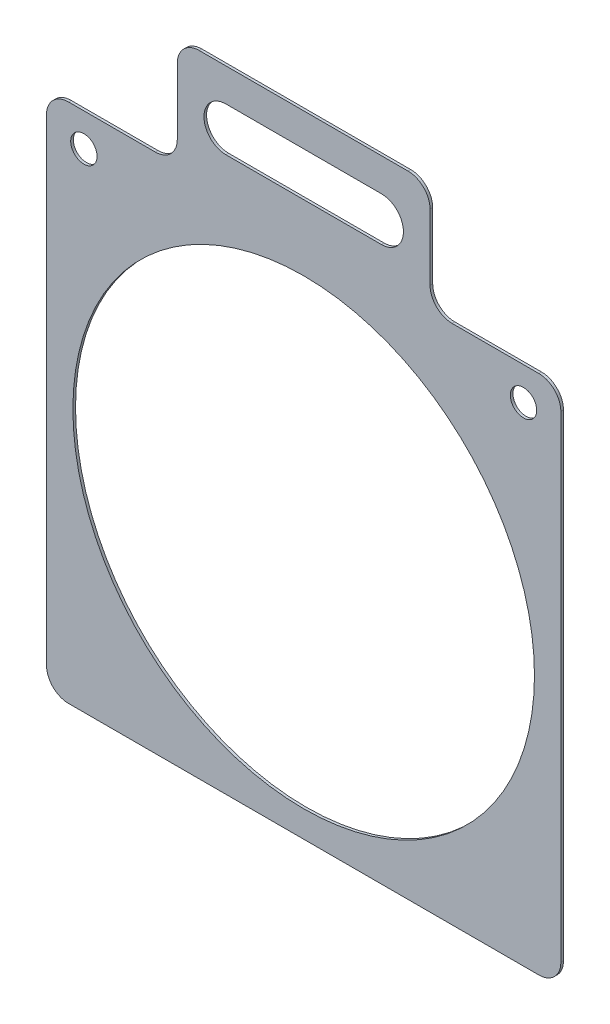
ISO-10303-21;
HEADER;
FILE_DESCRIPTION(('STEP AP214'),'2;1');
FILE_NAME('part.step','',(''),(''),'','','');
FILE_SCHEMA(('AUTOMOTIVE_DESIGN { 1 0 10303 214 1 1 1 1 }'));
ENDSEC;
DATA;
#1=APPLICATION_CONTEXT('core data for automotive mechanical design processes');
#2=APPLICATION_PROTOCOL_DEFINITION('international standard','automotive_design',2000,#1);
#3=PRODUCT_CONTEXT('',#1,'mechanical');
#4=PRODUCT('Part','Part','',(#3));
#5=PRODUCT_RELATED_PRODUCT_CATEGORY('part','',(#4));
#6=PRODUCT_DEFINITION_FORMATION('','',#4);
#7=PRODUCT_DEFINITION_CONTEXT('part definition',#1,'design');
#8=PRODUCT_DEFINITION('design','',#6,#7);
#9=PRODUCT_DEFINITION_SHAPE('','',#8);
#10=(LENGTH_UNIT() NAMED_UNIT(*) SI_UNIT(.MILLI.,.METRE.));
#11=(NAMED_UNIT(*) PLANE_ANGLE_UNIT() SI_UNIT($,.RADIAN.));
#12=(NAMED_UNIT(*) SI_UNIT($,.STERADIAN.) SOLID_ANGLE_UNIT());
#13=UNCERTAINTY_MEASURE_WITH_UNIT(LENGTH_MEASURE(1.E-05),#10,'distance_accuracy_value','');
#14=(GEOMETRIC_REPRESENTATION_CONTEXT(3) GLOBAL_UNCERTAINTY_ASSIGNED_CONTEXT((#13)) GLOBAL_UNIT_ASSIGNED_CONTEXT((#10,
#11,#12)) REPRESENTATION_CONTEXT('',''));
#15=CARTESIAN_POINT('',(0.,0.,0.));
#16=DIRECTION('',(0.,0.,1.));
#17=DIRECTION('',(1.,0.,0.));
#18=AXIS2_PLACEMENT_3D('',#15,#16,#17);
#19=CARTESIAN_POINT('',(-117.,120.,1.19999999999999));
#20=DIRECTION('',(0.,-1.,0.));
#21=DIRECTION('',(1.,0.,0.));
#22=AXIS2_PLACEMENT_3D('',#19,#20,#21);
#23=PLANE('',#22);
#24=DIRECTION('',(-1.,0.,0.));
#25=VECTOR('',#24,1.);
#26=CARTESIAN_POINT('',(-117.,120.,1.19999999999999));
#27=LINE('',#26,#25);
#28=CARTESIAN_POINT('',(-67.5000000000002,120.000000000001,1.19999999999999));
#29=VERTEX_POINT('',#28);
#30=CARTESIAN_POINT('',(-107.,120.,1.19999999999999));
#31=VERTEX_POINT('',#30);
#32=EDGE_CURVE('E276',#29,#31,#27,.T.);
#33=ORIENTED_EDGE('',*,*,#32,.F.);
#34=DIRECTION('',(0.,0.,1.));
#35=VECTOR('',#34,1.);
#36=CARTESIAN_POINT('',(-67.5000000000002,120.000000000001,1.19999999999999));
#37=LINE('',#36,#35);
#38=CARTESIAN_POINT('',(-67.5000000000002,120.000000000001,0.));
#39=VERTEX_POINT('',#38);
#40=EDGE_CURVE('E361',#29,#39,#37,.F.);
#41=ORIENTED_EDGE('',*,*,#40,.T.);
#42=DIRECTION('',(-1.,0.,0.));
#43=VECTOR('',#42,1.);
#44=CARTESIAN_POINT('',(-117.,120.,0.));
#45=LINE('',#44,#43);
#46=CARTESIAN_POINT('',(-107.,120.,0.));
#47=VERTEX_POINT('',#46);
#48=EDGE_CURVE('E291',#39,#47,#45,.T.);
#49=ORIENTED_EDGE('',*,*,#48,.T.);
#50=DIRECTION('',(0.,0.,-1.));
#51=VECTOR('',#50,1.);
#52=CARTESIAN_POINT('',(-107.,120.,1.19999999999999));
#53=LINE('',#52,#51);
#54=EDGE_CURVE('E358',#47,#31,#53,.F.);
#55=ORIENTED_EDGE('',*,*,#54,.T.);
#56=EDGE_LOOP('',(#33,#41,#49,#55));
#57=FACE_BOUND('',#56,.T.);
#58=ADVANCED_FACE('F40',(#57),#23,.F.);
#59=CARTESIAN_POINT('',(0.,0.,1.19999999999998));
#60=DIRECTION('',(0.,0.,1.));
#61=DIRECTION('',(1.,0.,0.));
#62=AXIS2_PLACEMENT_3D('',#59,#60,#61);
#63=PLANE('',#62);
#64=CARTESIAN_POINT('',(-100.,105.,1.19999999999999));
#65=DIRECTION('',(0.,0.,1.));
#66=DIRECTION('',(1.,0.,0.));
#67=AXIS2_PLACEMENT_3D('',#64,#65,#66);
#68=CIRCLE('',#67,6.);
#69=CARTESIAN_POINT('',(-94.0000000000001,105.,1.19999999999999));
#70=VERTEX_POINT('',#69);
#71=EDGE_CURVE('E247',#70,#70,#68,.T.);
#72=ORIENTED_EDGE('',*,*,#71,.F.);
#73=EDGE_LOOP('',(#72));
#74=FACE_BOUND('',#73,.T.);
#75=DIRECTION('',(0.,1.,0.));
#76=VECTOR('',#75,1.);
#77=CARTESIAN_POINT('',(57.5000000000001,170.000000000002,1.19999999999999));
#78=LINE('',#77,#76);
#79=CARTESIAN_POINT('',(57.5000000000003,130.000000000001,1.19999999999999));
#80=VERTEX_POINT('',#79);
#81=CARTESIAN_POINT('',(57.5000000000001,160.000000000002,1.19999999999999));
#82=VERTEX_POINT('',#81);
#83=EDGE_CURVE('E217',#80,#82,#78,.T.);
#84=ORIENTED_EDGE('',*,*,#83,.T.);
#85=CARTESIAN_POINT('',(47.5,160.000000000002,1.19999999999999));
#86=DIRECTION('',(0.,0.,1.));
#87=DIRECTION('',(1.,0.,0.));
#88=AXIS2_PLACEMENT_3D('',#85,#86,#87);
#89=CIRCLE('',#88,10.);
#90=CARTESIAN_POINT('',(47.5000000000002,170.000000000002,1.19999999999999));
#91=VERTEX_POINT('',#90);
#92=EDGE_CURVE('E325',#82,#91,#89,.T.);
#93=ORIENTED_EDGE('',*,*,#92,.T.);
#94=DIRECTION('',(-1.,0.,0.));
#95=VECTOR('',#94,1.);
#96=CARTESIAN_POINT('',(-57.5000000000002,170.000000000002,1.19999999999999));
#97=LINE('',#96,#95);
#98=CARTESIAN_POINT('',(-47.5000000000001,170.000000000002,1.19999999999999));
#99=VERTEX_POINT('',#98);
#100=EDGE_CURVE('E225',#91,#99,#97,.T.);
#101=ORIENTED_EDGE('',*,*,#100,.T.);
#102=CARTESIAN_POINT('',(-47.5,160.000000000002,1.19999999999999));
#103=DIRECTION('',(0.,0.,1.));
#104=DIRECTION('',(1.,0.,0.));
#105=AXIS2_PLACEMENT_3D('',#102,#103,#104);
#106=CIRCLE('',#105,10.);
#107=CARTESIAN_POINT('',(-57.5000000000002,160.000000000002,1.19999999999999));
#108=VERTEX_POINT('',#107);
#109=EDGE_CURVE('E322',#99,#108,#106,.T.);
#110=ORIENTED_EDGE('',*,*,#109,.T.);
#111=DIRECTION('',(0.,-1.,0.));
#112=VECTOR('',#111,1.);
#113=CARTESIAN_POINT('',(-57.4999999999999,120.000000000002,1.19999999999999));
#114=LINE('',#113,#112);
#115=CARTESIAN_POINT('',(-57.5000000000002,130.000000000001,1.19999999999998));
#116=VERTEX_POINT('',#115);
#117=EDGE_CURVE('E229',#108,#116,#114,.T.);
#118=ORIENTED_EDGE('',*,*,#117,.T.);
#119=CARTESIAN_POINT('',(-67.5,130.000000000001,1.19999999999999));
#120=DIRECTION('',(0.,0.,1.));
#121=DIRECTION('',(1.,0.,0.));
#122=AXIS2_PLACEMENT_3D('',#119,#120,#121);
#123=CIRCLE('',#122,10.);
#124=EDGE_CURVE('E49',#116,#29,#123,.F.);
#125=ORIENTED_EDGE('',*,*,#124,.T.);
#126=ORIENTED_EDGE('',*,*,#32,.T.);
#127=CARTESIAN_POINT('',(-107.,110.,1.19999999999999));
#128=DIRECTION('',(0.,0.,1.));
#129=DIRECTION('',(1.,0.,0.));
#130=AXIS2_PLACEMENT_3D('',#127,#128,#129);
#131=CIRCLE('',#130,10.);
#132=CARTESIAN_POINT('',(-117.,110.,1.19999999999999));
#133=VERTEX_POINT('',#132);
#134=EDGE_CURVE('E319',#31,#133,#131,.T.);
#135=ORIENTED_EDGE('',*,*,#134,.T.);
#136=DIRECTION('',(0.,-1.,0.));
#137=VECTOR('',#136,1.);
#138=CARTESIAN_POINT('',(-117.,120.,1.19999999999999));
#139=LINE('',#138,#137);
#140=CARTESIAN_POINT('',(-117.,-107.,1.19999999999998));
#141=VERTEX_POINT('',#140);
#142=EDGE_CURVE('E263',#133,#141,#139,.T.);
#143=ORIENTED_EDGE('',*,*,#142,.T.);
#144=CARTESIAN_POINT('',(-107.,-107.,1.19999999999998));
#145=DIRECTION('',(0.,0.,1.));
#146=DIRECTION('',(1.,0.,0.));
#147=AXIS2_PLACEMENT_3D('',#144,#145,#146);
#148=CIRCLE('',#147,10.);
#149=CARTESIAN_POINT('',(-107.,-117.,1.19999999999998));
#150=VERTEX_POINT('',#149);
#151=EDGE_CURVE('E313',#141,#150,#148,.T.);
#152=ORIENTED_EDGE('',*,*,#151,.T.);
#153=DIRECTION('',(1.,0.,0.));
#154=VECTOR('',#153,1.);
#155=CARTESIAN_POINT('',(-117.,-117.,1.19999999999998));
#156=LINE('',#155,#154);
#157=CARTESIAN_POINT('',(107.,-117.,1.19999999999998));
#158=VERTEX_POINT('',#157);
#159=EDGE_CURVE('E267',#150,#158,#156,.T.);
#160=ORIENTED_EDGE('',*,*,#159,.T.);
#161=CARTESIAN_POINT('',(107.,-107.,1.19999999999998));
#162=DIRECTION('',(0.,0.,1.));
#163=DIRECTION('',(1.,0.,0.));
#164=AXIS2_PLACEMENT_3D('',#161,#162,#163);
#165=CIRCLE('',#164,10.);
#166=CARTESIAN_POINT('',(117.,-107.,1.19999999999998));
#167=VERTEX_POINT('',#166);
#168=EDGE_CURVE('E316',#158,#167,#165,.T.);
#169=ORIENTED_EDGE('',*,*,#168,.T.);
#170=DIRECTION('',(0.,1.,0.));
#171=VECTOR('',#170,1.);
#172=CARTESIAN_POINT('',(117.,120.000000000001,1.19999999999998));
#173=LINE('',#172,#171);
#174=CARTESIAN_POINT('',(117.,110.,1.19999999999998));
#175=VERTEX_POINT('',#174);
#176=EDGE_CURVE('E272',#167,#175,#173,.T.);
#177=ORIENTED_EDGE('',*,*,#176,.T.);
#178=CARTESIAN_POINT('',(107.,110.000000000001,1.19999999999998));
#179=DIRECTION('',(0.,0.,1.));
#180=DIRECTION('',(1.,0.,0.));
#181=AXIS2_PLACEMENT_3D('',#178,#179,#180);
#182=CIRCLE('',#181,10.);
#183=CARTESIAN_POINT('',(107.,120.000000000001,1.19999999999998));
#184=VERTEX_POINT('',#183);
#185=EDGE_CURVE('E310',#175,#184,#182,.T.);
#186=ORIENTED_EDGE('',*,*,#185,.T.);
#187=CARTESIAN_POINT('',(67.5000000000001,120.000000000001,1.19999999999998));
#188=VERTEX_POINT('',#187);
#189=EDGE_CURVE('E280',#184,#188,#27,.T.);
#190=ORIENTED_EDGE('',*,*,#189,.T.);
#191=CARTESIAN_POINT('',(67.5000000000003,130.000000000001,1.19999999999998));
#192=DIRECTION('',(0.,0.,1.));
#193=DIRECTION('',(1.,0.,0.));
#194=AXIS2_PLACEMENT_3D('',#191,#192,#193);
#195=CIRCLE('',#194,10.);
#196=EDGE_CURVE('E384',#188,#80,#195,.F.);
#197=ORIENTED_EDGE('',*,*,#196,.T.);
#198=EDGE_LOOP('',(#84,#93,#101,#110,#118,#125,#126,#135,#143,#152,#160,#169,#177,#186,#190,#197));
#199=FACE_BOUND('',#198,.T.);
#200=CARTESIAN_POINT('',(0.,0.,1.19999999999998));
#201=DIRECTION('',(0.,0.,1.));
#202=DIRECTION('',(1.,0.,0.));
#203=AXIS2_PLACEMENT_3D('',#200,#201,#202);
#204=CIRCLE('',#203,105.);
#205=CARTESIAN_POINT('',(105.,0.,1.19999999999998));
#206=VERTEX_POINT('',#205);
#207=EDGE_CURVE('E255',#206,#206,#204,.T.);
#208=ORIENTED_EDGE('',*,*,#207,.F.);
#209=EDGE_LOOP('',(#208));
#210=FACE_BOUND('',#209,.T.);
#211=CARTESIAN_POINT('',(100.,105.000000000001,1.19999999999998));
#212=DIRECTION('',(0.,0.,1.));
#213=DIRECTION('',(-1.,0.,0.));
#214=AXIS2_PLACEMENT_3D('',#211,#212,#213);
#215=CIRCLE('',#214,6.);
#216=CARTESIAN_POINT('',(94.0000000000002,105.000000000001,1.19999999999998));
#217=VERTEX_POINT('',#216);
#218=EDGE_CURVE('E237',#217,#217,#215,.T.);
#219=ORIENTED_EDGE('',*,*,#218,.F.);
#220=EDGE_LOOP('',(#219));
#221=FACE_BOUND('',#220,.T.);
#222=DIRECTION('',(1.,0.,0.));
#223=VECTOR('',#222,1.);
#224=CARTESIAN_POINT('',(-35.3706002300001,134.999999999999,1.19999999999999));
#225=LINE('',#224,#223);
#226=CARTESIAN_POINT('',(-35.3706002300001,134.999999999999,1.19999999999999));
#227=VERTEX_POINT('',#226);
#228=CARTESIAN_POINT('',(35.3706002300002,135.,1.19999999999999));
#229=VERTEX_POINT('',#228);
#230=EDGE_CURVE('E195',#227,#229,#225,.T.);
#231=ORIENTED_EDGE('',*,*,#230,.F.);
#232=CARTESIAN_POINT('',(-35.3706002300002,145.000000000002,1.19999999999999));
#233=DIRECTION('',(0.,0.,1.));
#234=DIRECTION('',(1.,0.,0.));
#235=AXIS2_PLACEMENT_3D('',#232,#233,#234);
#236=CIRCLE('',#235,10.0000000000015);
#237=CARTESIAN_POINT('',(-35.3706002300001,155.000000000002,1.19999999999999));
#238=VERTEX_POINT('',#237);
#239=EDGE_CURVE('E202',#238,#227,#236,.T.);
#240=ORIENTED_EDGE('',*,*,#239,.F.);
#241=DIRECTION('',(-1.,0.,0.));
#242=VECTOR('',#241,1.);
#243=CARTESIAN_POINT('',(-35.3706002300001,155.000000000002,1.19999999999999));
#244=LINE('',#243,#242);
#245=CARTESIAN_POINT('',(35.37060023,155.000000000002,1.19999999999999));
#246=VERTEX_POINT('',#245);
#247=EDGE_CURVE('E206',#246,#238,#244,.T.);
#248=ORIENTED_EDGE('',*,*,#247,.F.);
#249=CARTESIAN_POINT('',(35.3706002300001,145.000000000002,1.19999999999999));
#250=DIRECTION('',(0.,0.,1.));
#251=DIRECTION('',(1.,0.,0.));
#252=AXIS2_PLACEMENT_3D('',#249,#250,#251);
#253=CIRCLE('',#252,10.0000000000015);
#254=EDGE_CURVE('E185',#229,#246,#253,.T.);
#255=ORIENTED_EDGE('',*,*,#254,.F.);
#256=EDGE_LOOP('',(#231,#240,#248,#255));
#257=FACE_BOUND('',#256,.T.);
#258=ADVANCED_FACE('F204',(#74,#199,#210,#221,#257),#63,.T.);
#259=CARTESIAN_POINT('',(0.,0.,0.));
#260=DIRECTION('',(0.,0.,1.));
#261=DIRECTION('',(1.,0.,0.));
#262=AXIS2_PLACEMENT_3D('',#259,#260,#261);
#263=PLANE('',#262);
#264=DIRECTION('',(1.,0.,0.));
#265=VECTOR('',#264,1.);
#266=CARTESIAN_POINT('',(-57.5000000000002,170.000000000002,0.));
#267=LINE('',#266,#265);
#268=CARTESIAN_POINT('',(-47.5000000000001,170.000000000002,0.));
#269=VERTEX_POINT('',#268);
#270=CARTESIAN_POINT('',(47.5000000000002,170.000000000002,0.));
#271=VERTEX_POINT('',#270);
#272=EDGE_CURVE('E236',#269,#271,#267,.T.);
#273=ORIENTED_EDGE('',*,*,#272,.T.);
#274=CARTESIAN_POINT('',(47.5,160.000000000002,0.));
#275=DIRECTION('',(0.,0.,1.));
#276=DIRECTION('',(1.,0.,0.));
#277=AXIS2_PLACEMENT_3D('',#274,#275,#276);
#278=CIRCLE('',#277,10.);
#279=CARTESIAN_POINT('',(57.5000000000001,160.000000000002,0.));
#280=VERTEX_POINT('',#279);
#281=EDGE_CURVE('E348',#271,#280,#278,.F.);
#282=ORIENTED_EDGE('',*,*,#281,.T.);
#283=DIRECTION('',(0.,-1.,0.));
#284=VECTOR('',#283,1.);
#285=CARTESIAN_POINT('',(57.5000000000001,170.000000000002,0.));
#286=LINE('',#285,#284);
#287=CARTESIAN_POINT('',(57.5000000000003,130.000000000001,0.));
#288=VERTEX_POINT('',#287);
#289=EDGE_CURVE('E246',#280,#288,#286,.T.);
#290=ORIENTED_EDGE('',*,*,#289,.T.);
#291=CARTESIAN_POINT('',(67.5000000000003,130.000000000001,0.));
#292=DIRECTION('',(0.,0.,1.));
#293=DIRECTION('',(1.,0.,0.));
#294=AXIS2_PLACEMENT_3D('',#291,#292,#293);
#295=CIRCLE('',#294,10.);
#296=CARTESIAN_POINT('',(67.5000000000001,120.000000000001,0.));
#297=VERTEX_POINT('',#296);
#298=EDGE_CURVE('E387',#288,#297,#295,.T.);
#299=ORIENTED_EDGE('',*,*,#298,.T.);
#300=CARTESIAN_POINT('',(107.,120.000000000001,0.));
#301=VERTEX_POINT('',#300);
#302=EDGE_CURVE('E268',#301,#297,#45,.T.);
#303=ORIENTED_EDGE('',*,*,#302,.F.);
#304=CARTESIAN_POINT('',(107.,110.000000000001,0.));
#305=DIRECTION('',(0.,0.,1.));
#306=DIRECTION('',(1.,0.,0.));
#307=AXIS2_PLACEMENT_3D('',#304,#305,#306);
#308=CIRCLE('',#307,10.);
#309=CARTESIAN_POINT('',(117.,110.,0.));
#310=VERTEX_POINT('',#309);
#311=EDGE_CURVE('E335',#301,#310,#308,.F.);
#312=ORIENTED_EDGE('',*,*,#311,.T.);
#313=DIRECTION('',(0.,1.,0.));
#314=VECTOR('',#313,1.);
#315=CARTESIAN_POINT('',(117.,120.000000000001,0.));
#316=LINE('',#315,#314);
#317=CARTESIAN_POINT('',(117.,-107.,0.));
#318=VERTEX_POINT('',#317);
#319=EDGE_CURVE('E287',#318,#310,#316,.T.);
#320=ORIENTED_EDGE('',*,*,#319,.F.);
#321=CARTESIAN_POINT('',(107.,-107.,0.));
#322=DIRECTION('',(0.,0.,1.));
#323=DIRECTION('',(1.,0.,0.));
#324=AXIS2_PLACEMENT_3D('',#321,#322,#323);
#325=CIRCLE('',#324,10.);
#326=CARTESIAN_POINT('',(107.,-117.,0.));
#327=VERTEX_POINT('',#326);
#328=EDGE_CURVE('E56',#318,#327,#325,.F.);
#329=ORIENTED_EDGE('',*,*,#328,.T.);
#330=DIRECTION('',(1.,0.,0.));
#331=VECTOR('',#330,1.);
#332=CARTESIAN_POINT('',(-117.,-117.,0.));
#333=LINE('',#332,#331);
#334=CARTESIAN_POINT('',(-107.,-117.,0.));
#335=VERTEX_POINT('',#334);
#336=EDGE_CURVE('E284',#335,#327,#333,.T.);
#337=ORIENTED_EDGE('',*,*,#336,.F.);
#338=CARTESIAN_POINT('',(-107.,-107.,0.));
#339=DIRECTION('',(0.,0.,1.));
#340=DIRECTION('',(1.,0.,0.));
#341=AXIS2_PLACEMENT_3D('',#338,#339,#340);
#342=CIRCLE('',#341,10.);
#343=CARTESIAN_POINT('',(-117.,-107.,0.));
#344=VERTEX_POINT('',#343);
#345=EDGE_CURVE('E64',#335,#344,#342,.F.);
#346=ORIENTED_EDGE('',*,*,#345,.T.);
#347=DIRECTION('',(0.,-1.,0.));
#348=VECTOR('',#347,1.);
#349=CARTESIAN_POINT('',(-117.,120.,0.));
#350=LINE('',#349,#348);
#351=CARTESIAN_POINT('',(-117.,110.,0.));
#352=VERTEX_POINT('',#351);
#353=EDGE_CURVE('E259',#352,#344,#350,.T.);
#354=ORIENTED_EDGE('',*,*,#353,.F.);
#355=CARTESIAN_POINT('',(-107.,110.,0.));
#356=DIRECTION('',(0.,0.,1.));
#357=DIRECTION('',(1.,0.,0.));
#358=AXIS2_PLACEMENT_3D('',#355,#356,#357);
#359=CIRCLE('',#358,10.);
#360=EDGE_CURVE('E342',#352,#47,#359,.F.);
#361=ORIENTED_EDGE('',*,*,#360,.T.);
#362=ORIENTED_EDGE('',*,*,#48,.F.);
#363=CARTESIAN_POINT('',(-67.5,130.000000000001,0.));
#364=DIRECTION('',(0.,0.,1.));
#365=DIRECTION('',(1.,0.,0.));
#366=AXIS2_PLACEMENT_3D('',#363,#364,#365);
#367=CIRCLE('',#366,10.);
#368=CARTESIAN_POINT('',(-57.5000000000002,130.000000000001,0.));
#369=VERTEX_POINT('',#368);
#370=EDGE_CURVE('E11',#39,#369,#367,.T.);
#371=ORIENTED_EDGE('',*,*,#370,.T.);
#372=DIRECTION('',(0.,1.,0.));
#373=VECTOR('',#372,1.);
#374=CARTESIAN_POINT('',(-57.4999999999999,120.000000000002,0.));
#375=LINE('',#374,#373);
#376=CARTESIAN_POINT('',(-57.5000000000002,160.000000000002,0.));
#377=VERTEX_POINT('',#376);
#378=EDGE_CURVE('E410',#369,#377,#375,.T.);
#379=ORIENTED_EDGE('',*,*,#378,.T.);
#380=CARTESIAN_POINT('',(-47.5,160.000000000002,0.));
#381=DIRECTION('',(0.,0.,1.));
#382=DIRECTION('',(1.,0.,0.));
#383=AXIS2_PLACEMENT_3D('',#380,#381,#382);
#384=CIRCLE('',#383,10.);
#385=EDGE_CURVE('E345',#377,#269,#384,.F.);
#386=ORIENTED_EDGE('',*,*,#385,.T.);
#387=EDGE_LOOP('',(#273,#282,#290,#299,#303,#312,#320,#329,#337,#346,#354,#361,#362,#371,#379,#386));
#388=FACE_BOUND('',#387,.T.);
#389=CARTESIAN_POINT('',(0.,0.,0.));
#390=DIRECTION('',(0.,0.,1.));
#391=DIRECTION('',(1.,0.,0.));
#392=AXIS2_PLACEMENT_3D('',#389,#390,#391);
#393=CIRCLE('',#392,105.);
#394=CARTESIAN_POINT('',(105.,0.,0.));
#395=VERTEX_POINT('',#394);
#396=EDGE_CURVE('E251',#395,#395,#393,.T.);
#397=ORIENTED_EDGE('',*,*,#396,.T.);
#398=EDGE_LOOP('',(#397));
#399=FACE_BOUND('',#398,.T.);
#400=CARTESIAN_POINT('',(-100.,105.,0.));
#401=DIRECTION('',(0.,0.,1.));
#402=DIRECTION('',(1.,0.,0.));
#403=AXIS2_PLACEMENT_3D('',#400,#401,#402);
#404=CIRCLE('',#403,6.);
#405=CARTESIAN_POINT('',(-94.0000000000001,105.,0.));
#406=VERTEX_POINT('',#405);
#407=EDGE_CURVE('E241',#406,#406,#404,.T.);
#408=ORIENTED_EDGE('',*,*,#407,.T.);
#409=EDGE_LOOP('',(#408));
#410=FACE_BOUND('',#409,.T.);
#411=CARTESIAN_POINT('',(100.,105.000000000001,0.));
#412=DIRECTION('',(0.,0.,1.));
#413=DIRECTION('',(-1.,0.,0.));
#414=AXIS2_PLACEMENT_3D('',#411,#412,#413);
#415=CIRCLE('',#414,6.);
#416=CARTESIAN_POINT('',(94.0000000000002,105.000000000001,0.));
#417=VERTEX_POINT('',#416);
#418=EDGE_CURVE('E242',#417,#417,#415,.T.);
#419=ORIENTED_EDGE('',*,*,#418,.T.);
#420=EDGE_LOOP('',(#419));
#421=FACE_BOUND('',#420,.T.);
#422=DIRECTION('',(-1.,0.,0.));
#423=VECTOR('',#422,1.);
#424=CARTESIAN_POINT('',(-35.3706002300001,134.999999999999,0.));
#425=LINE('',#424,#423);
#426=CARTESIAN_POINT('',(35.3706002300001,134.999999999999,0.));
#427=VERTEX_POINT('',#426);
#428=CARTESIAN_POINT('',(-35.3706002300001,134.999999999999,0.));
#429=VERTEX_POINT('',#428);
#430=EDGE_CURVE('E233',#427,#429,#425,.T.);
#431=ORIENTED_EDGE('',*,*,#430,.F.);
#432=CARTESIAN_POINT('',(35.3706002300001,145.000000000002,0.));
#433=DIRECTION('',(0.,0.,1.));
#434=DIRECTION('',(1.,0.,0.));
#435=AXIS2_PLACEMENT_3D('',#432,#433,#434);
#436=CIRCLE('',#435,10.0000000000015);
#437=CARTESIAN_POINT('',(35.3706002300002,155.000000000004,0.));
#438=VERTEX_POINT('',#437);
#439=EDGE_CURVE('E187',#438,#427,#436,.F.);
#440=ORIENTED_EDGE('',*,*,#439,.F.);
#441=DIRECTION('',(1.,0.,0.));
#442=VECTOR('',#441,1.);
#443=CARTESIAN_POINT('',(-35.3706002300001,155.000000000002,0.));
#444=LINE('',#443,#442);
#445=CARTESIAN_POINT('',(-35.3706002300001,155.000000000002,0.));
#446=VERTEX_POINT('',#445);
#447=EDGE_CURVE('E420',#446,#438,#444,.T.);
#448=ORIENTED_EDGE('',*,*,#447,.F.);
#449=CARTESIAN_POINT('',(-35.3706002300002,145.000000000002,0.));
#450=DIRECTION('',(0.,0.,1.));
#451=DIRECTION('',(1.,0.,0.));
#452=AXIS2_PLACEMENT_3D('',#449,#450,#451);
#453=CIRCLE('',#452,10.0000000000015);
#454=EDGE_CURVE('E415',#429,#446,#453,.F.);
#455=ORIENTED_EDGE('',*,*,#454,.F.);
#456=EDGE_LOOP('',(#431,#440,#448,#455));
#457=FACE_BOUND('',#456,.T.);
#458=ADVANCED_FACE('F408',(#388,#399,#410,#421,#457),#263,.F.);
#459=CARTESIAN_POINT('',(-117.,120.,1.19999999999999));
#460=DIRECTION('',(1.,0.,0.));
#461=DIRECTION('',(0.,1.,0.));
#462=AXIS2_PLACEMENT_3D('',#459,#460,#461);
#463=PLANE('',#462);
#464=ORIENTED_EDGE('',*,*,#142,.F.);
#465=DIRECTION('',(0.,0.,-1.));
#466=VECTOR('',#465,1.);
#467=CARTESIAN_POINT('',(-117.,110.,1.19999999999999));
#468=LINE('',#467,#466);
#469=EDGE_CURVE('E367',#133,#352,#468,.T.);
#470=ORIENTED_EDGE('',*,*,#469,.T.);
#471=ORIENTED_EDGE('',*,*,#353,.T.);
#472=DIRECTION('',(0.,0.,-1.));
#473=VECTOR('',#472,1.);
#474=CARTESIAN_POINT('',(-117.,-107.,1.19999999999998));
#475=LINE('',#474,#473);
#476=EDGE_CURVE('E364',#344,#141,#475,.F.);
#477=ORIENTED_EDGE('',*,*,#476,.T.);
#478=EDGE_LOOP('',(#464,#470,#471,#477));
#479=FACE_BOUND('',#478,.T.);
#480=ADVANCED_FACE('F482',(#479),#463,.F.);
#481=CARTESIAN_POINT('',(-117.,-117.,1.19999999999998));
#482=DIRECTION('',(0.,1.,0.));
#483=DIRECTION('',(-1.,0.,0.));
#484=AXIS2_PLACEMENT_3D('',#481,#482,#483);
#485=PLANE('',#484);
#486=ORIENTED_EDGE('',*,*,#336,.T.);
#487=DIRECTION('',(0.,0.,-1.));
#488=VECTOR('',#487,1.);
#489=CARTESIAN_POINT('',(107.,-117.,1.19999999999998));
#490=LINE('',#489,#488);
#491=EDGE_CURVE('E381',#327,#158,#490,.F.);
#492=ORIENTED_EDGE('',*,*,#491,.T.);
#493=ORIENTED_EDGE('',*,*,#159,.F.);
#494=DIRECTION('',(0.,0.,-1.));
#495=VECTOR('',#494,1.);
#496=CARTESIAN_POINT('',(-107.,-117.,1.19999999999998));
#497=LINE('',#496,#495);
#498=EDGE_CURVE('E378',#150,#335,#497,.T.);
#499=ORIENTED_EDGE('',*,*,#498,.T.);
#500=EDGE_LOOP('',(#486,#492,#493,#499));
#501=FACE_BOUND('',#500,.T.);
#502=ADVANCED_FACE('F476',(#501),#485,.F.);
#503=CARTESIAN_POINT('',(117.,120.000000000001,1.19999999999998));
#504=DIRECTION('',(-1.,0.,0.));
#505=DIRECTION('',(0.,-1.,0.));
#506=AXIS2_PLACEMENT_3D('',#503,#504,#505);
#507=PLANE('',#506);
#508=ORIENTED_EDGE('',*,*,#176,.F.);
#509=DIRECTION('',(0.,0.,-1.));
#510=VECTOR('',#509,1.);
#511=CARTESIAN_POINT('',(117.,-107.,1.19999999999998));
#512=LINE('',#511,#510);
#513=EDGE_CURVE('E374',#167,#318,#512,.T.);
#514=ORIENTED_EDGE('',*,*,#513,.T.);
#515=ORIENTED_EDGE('',*,*,#319,.T.);
#516=DIRECTION('',(0.,0.,-1.));
#517=VECTOR('',#516,1.);
#518=CARTESIAN_POINT('',(117.,110.,1.19999999999998));
#519=LINE('',#518,#517);
#520=EDGE_CURVE('E371',#310,#175,#519,.F.);
#521=ORIENTED_EDGE('',*,*,#520,.T.);
#522=EDGE_LOOP('',(#508,#514,#515,#521));
#523=FACE_BOUND('',#522,.T.);
#524=ADVANCED_FACE('F468',(#523),#507,.F.);
#525=ORIENTED_EDGE('',*,*,#302,.T.);
#526=DIRECTION('',(0.,0.,1.));
#527=VECTOR('',#526,1.);
#528=CARTESIAN_POINT('',(67.5000000000003,120.000000000001,1.19999999999998));
#529=LINE('',#528,#527);
#530=EDGE_CURVE('E299',#297,#188,#529,.T.);
#531=ORIENTED_EDGE('',*,*,#530,.T.);
#532=ORIENTED_EDGE('',*,*,#189,.F.);
#533=DIRECTION('',(0.,0.,-1.));
#534=VECTOR('',#533,1.);
#535=CARTESIAN_POINT('',(107.,120.,1.19999999999998));
#536=LINE('',#535,#534);
#537=EDGE_CURVE('E295',#184,#301,#536,.T.);
#538=ORIENTED_EDGE('',*,*,#537,.T.);
#539=EDGE_LOOP('',(#525,#531,#532,#538));
#540=FACE_BOUND('',#539,.T.);
#541=ADVANCED_FACE('F457',(#540),#23,.F.);
#542=CARTESIAN_POINT('',(0.,0.,1.19999999999998));
#543=DIRECTION('',(0.,0.,-1.));
#544=DIRECTION('',(-1.,0.,0.));
#545=AXIS2_PLACEMENT_3D('',#542,#543,#544);
#546=CYLINDRICAL_SURFACE('',#545,105.);
#547=ORIENTED_EDGE('',*,*,#207,.T.);
#548=EDGE_LOOP('',(#547));
#549=FACE_BOUND('',#548,.T.);
#550=ORIENTED_EDGE('',*,*,#396,.F.);
#551=EDGE_LOOP('',(#550));
#552=FACE_BOUND('',#551,.T.);
#553=ADVANCED_FACE('F505',(#549,#552),#546,.F.);
#554=CARTESIAN_POINT('',(-100.,105.,1.19999999999999));
#555=DIRECTION('',(0.,0.,-1.));
#556=DIRECTION('',(-1.,0.,0.));
#557=AXIS2_PLACEMENT_3D('',#554,#555,#556);
#558=CYLINDRICAL_SURFACE('',#557,6.);
#559=ORIENTED_EDGE('',*,*,#71,.T.);
#560=EDGE_LOOP('',(#559));
#561=FACE_BOUND('',#560,.T.);
#562=ORIENTED_EDGE('',*,*,#407,.F.);
#563=EDGE_LOOP('',(#562));
#564=FACE_BOUND('',#563,.T.);
#565=ADVANCED_FACE('F510',(#561,#564),#558,.F.);
#566=CARTESIAN_POINT('',(100.,105.000000000001,1.19999999999998));
#567=DIRECTION('',(0.,0.,-1.));
#568=DIRECTION('',(-1.,0.,0.));
#569=AXIS2_PLACEMENT_3D('',#566,#567,#568);
#570=CYLINDRICAL_SURFACE('',#569,6.);
#571=ORIENTED_EDGE('',*,*,#218,.T.);
#572=EDGE_LOOP('',(#571));
#573=FACE_BOUND('',#572,.T.);
#574=ORIENTED_EDGE('',*,*,#418,.F.);
#575=EDGE_LOOP('',(#574));
#576=FACE_BOUND('',#575,.T.);
#577=ADVANCED_FACE('F538',(#573,#576),#570,.F.);
#578=CARTESIAN_POINT('',(57.5000000000003,170.000000000002,-125.399362039844));
#579=DIRECTION('',(1.,0.,0.));
#580=DIRECTION('',(0.,1.,0.));
#581=AXIS2_PLACEMENT_3D('',#578,#579,#580);
#582=PLANE('',#581);
#583=ORIENTED_EDGE('',*,*,#83,.F.);
#584=DIRECTION('',(0.,0.,1.));
#585=VECTOR('',#584,1.);
#586=CARTESIAN_POINT('',(57.5000000000003,130.000000000001,-125.399362039844));
#587=LINE('',#586,#585);
#588=EDGE_CURVE('E307',#80,#288,#587,.F.);
#589=ORIENTED_EDGE('',*,*,#588,.T.);
#590=ORIENTED_EDGE('',*,*,#289,.F.);
#591=DIRECTION('',(0.,0.,1.));
#592=VECTOR('',#591,1.);
#593=CARTESIAN_POINT('',(57.5000000000002,160.000000000002,-125.399362039844));
#594=LINE('',#593,#592);
#595=EDGE_CURVE('E303',#280,#82,#594,.T.);
#596=ORIENTED_EDGE('',*,*,#595,.T.);
#597=EDGE_LOOP('',(#583,#589,#590,#596));
#598=FACE_BOUND('',#597,.T.);
#599=ADVANCED_FACE('F536',(#598),#582,.T.);
#600=CARTESIAN_POINT('',(-57.5000000000002,170.000000000002,-125.399362039844));
#601=DIRECTION('',(0.,1.,0.));
#602=DIRECTION('',(0.,0.,1.));
#603=AXIS2_PLACEMENT_3D('',#600,#601,#602);
#604=PLANE('',#603);
#605=ORIENTED_EDGE('',*,*,#100,.F.);
#606=DIRECTION('',(0.,0.,1.));
#607=VECTOR('',#606,1.);
#608=CARTESIAN_POINT('',(47.5000000000001,170.000000000002,-125.399362039844));
#609=LINE('',#608,#607);
#610=EDGE_CURVE('E332',#91,#271,#609,.F.);
#611=ORIENTED_EDGE('',*,*,#610,.T.);
#612=ORIENTED_EDGE('',*,*,#272,.F.);
#613=DIRECTION('',(0.,0.,1.));
#614=VECTOR('',#613,1.);
#615=CARTESIAN_POINT('',(-47.5000000000003,170.000000000002,-125.399362039844));
#616=LINE('',#615,#614);
#617=EDGE_CURVE('E328',#269,#99,#616,.T.);
#618=ORIENTED_EDGE('',*,*,#617,.T.);
#619=EDGE_LOOP('',(#605,#611,#612,#618));
#620=FACE_BOUND('',#619,.T.);
#621=ADVANCED_FACE('F534',(#620),#604,.T.);
#622=CARTESIAN_POINT('',(-57.5,120.000000000002,-125.399362039844));
#623=DIRECTION('',(-1.,0.,0.));
#624=DIRECTION('',(0.,0.,1.));
#625=AXIS2_PLACEMENT_3D('',#622,#623,#624);
#626=PLANE('',#625);
#627=ORIENTED_EDGE('',*,*,#117,.F.);
#628=DIRECTION('',(0.,0.,1.));
#629=VECTOR('',#628,1.);
#630=CARTESIAN_POINT('',(-57.5000000000001,160.000000000002,-125.399362039844));
#631=LINE('',#630,#629);
#632=EDGE_CURVE('E355',#108,#377,#631,.F.);
#633=ORIENTED_EDGE('',*,*,#632,.T.);
#634=ORIENTED_EDGE('',*,*,#378,.F.);
#635=DIRECTION('',(0.,0.,1.));
#636=VECTOR('',#635,1.);
#637=CARTESIAN_POINT('',(-57.5000000000002,130.000000000001,-125.399362039844));
#638=LINE('',#637,#636);
#639=EDGE_CURVE('E351',#369,#116,#638,.T.);
#640=ORIENTED_EDGE('',*,*,#639,.T.);
#641=EDGE_LOOP('',(#627,#633,#634,#640));
#642=FACE_BOUND('',#641,.T.);
#643=ADVANCED_FACE('F413',(#642),#626,.T.);
#644=CARTESIAN_POINT('',(-35.3706002300003,134.999999999999,-125.399362039844));
#645=DIRECTION('',(0.,-1.,0.));
#646=DIRECTION('',(0.,0.,-1.));
#647=AXIS2_PLACEMENT_3D('',#644,#645,#646);
#648=PLANE('',#647);
#649=DIRECTION('',(0.,0.,1.));
#650=VECTOR('',#649,1.);
#651=CARTESIAN_POINT('',(35.37060023,135.000000000001,-125.399362039844));
#652=LINE('',#651,#650);
#653=EDGE_CURVE('E180',#427,#229,#652,.T.);
#654=ORIENTED_EDGE('',*,*,#653,.F.);
#655=ORIENTED_EDGE('',*,*,#430,.T.);
#656=DIRECTION('',(0.,0.,1.));
#657=VECTOR('',#656,1.);
#658=CARTESIAN_POINT('',(-35.3706002300003,134.999999999999,-125.399362039844));
#659=LINE('',#658,#657);
#660=EDGE_CURVE('E192',#429,#227,#659,.T.);
#661=ORIENTED_EDGE('',*,*,#660,.T.);
#662=ORIENTED_EDGE('',*,*,#230,.T.);
#663=EDGE_LOOP('',(#654,#655,#661,#662));
#664=FACE_BOUND('',#663,.T.);
#665=ADVANCED_FACE('F196',(#664),#648,.F.);
#666=CARTESIAN_POINT('',(35.3706002300001,145.000000000002,-125.399362039844));
#667=DIRECTION('',(0.,0.,1.));
#668=DIRECTION('',(1.,0.,0.));
#669=AXIS2_PLACEMENT_3D('',#666,#667,#668);
#670=CYLINDRICAL_SURFACE('',#669,10.0000000000015);
#671=DIRECTION('',(0.,0.,1.));
#672=VECTOR('',#671,1.);
#673=CARTESIAN_POINT('',(35.37060023,155.000000000002,-125.399362039844));
#674=LINE('',#673,#672);
#675=EDGE_CURVE('E191',#438,#246,#674,.T.);
#676=ORIENTED_EDGE('',*,*,#675,.F.);
#677=ORIENTED_EDGE('',*,*,#439,.T.);
#678=ORIENTED_EDGE('',*,*,#653,.T.);
#679=ORIENTED_EDGE('',*,*,#254,.T.);
#680=EDGE_LOOP('',(#676,#677,#678,#679));
#681=FACE_BOUND('',#680,.T.);
#682=ADVANCED_FACE('F183',(#681),#670,.F.);
#683=CARTESIAN_POINT('',(-35.3706002300003,155.000000000002,-125.399362039844));
#684=DIRECTION('',(0.,1.,0.));
#685=DIRECTION('',(0.,0.,1.));
#686=AXIS2_PLACEMENT_3D('',#683,#684,#685);
#687=PLANE('',#686);
#688=DIRECTION('',(0.,0.,1.));
#689=VECTOR('',#688,1.);
#690=CARTESIAN_POINT('',(-35.3706002300003,155.000000000002,-125.399362039844));
#691=LINE('',#690,#689);
#692=EDGE_CURVE('E214',#446,#238,#691,.T.);
#693=ORIENTED_EDGE('',*,*,#692,.F.);
#694=ORIENTED_EDGE('',*,*,#447,.T.);
#695=ORIENTED_EDGE('',*,*,#675,.T.);
#696=ORIENTED_EDGE('',*,*,#247,.T.);
#697=EDGE_LOOP('',(#693,#694,#695,#696));
#698=FACE_BOUND('',#697,.T.);
#699=ADVANCED_FACE('F433',(#698),#687,.F.);
#700=CARTESIAN_POINT('',(-35.3706002300003,145.000000000002,-125.399362039844));
#701=DIRECTION('',(0.,0.,1.));
#702=DIRECTION('',(1.,0.,0.));
#703=AXIS2_PLACEMENT_3D('',#700,#701,#702);
#704=CYLINDRICAL_SURFACE('',#703,10.0000000000015);
#705=ORIENTED_EDGE('',*,*,#660,.F.);
#706=ORIENTED_EDGE('',*,*,#454,.T.);
#707=ORIENTED_EDGE('',*,*,#692,.T.);
#708=ORIENTED_EDGE('',*,*,#239,.T.);
#709=EDGE_LOOP('',(#705,#706,#707,#708));
#710=FACE_BOUND('',#709,.T.);
#711=ADVANCED_FACE('F429',(#710),#704,.F.);
#712=CARTESIAN_POINT('',(67.5000000000003,130.000000000001,1.19999999999998));
#713=DIRECTION('',(0.,0.,1.));
#714=DIRECTION('',(1.,0.,0.));
#715=AXIS2_PLACEMENT_3D('',#712,#713,#714);
#716=CYLINDRICAL_SURFACE('',#715,10.);
#717=ORIENTED_EDGE('',*,*,#298,.F.);
#718=ORIENTED_EDGE('',*,*,#588,.F.);
#719=ORIENTED_EDGE('',*,*,#196,.F.);
#720=ORIENTED_EDGE('',*,*,#530,.F.);
#721=EDGE_LOOP('',(#717,#718,#719,#720));
#722=FACE_BOUND('',#721,.T.);
#723=ADVANCED_FACE('F453',(#722),#716,.F.);
#724=CARTESIAN_POINT('',(47.5,160.000000000002,-125.399362039844));
#725=DIRECTION('',(0.,0.,1.));
#726=DIRECTION('',(1.,0.,0.));
#727=AXIS2_PLACEMENT_3D('',#724,#725,#726);
#728=CYLINDRICAL_SURFACE('',#727,10.);
#729=ORIENTED_EDGE('',*,*,#281,.F.);
#730=ORIENTED_EDGE('',*,*,#610,.F.);
#731=ORIENTED_EDGE('',*,*,#92,.F.);
#732=ORIENTED_EDGE('',*,*,#595,.F.);
#733=EDGE_LOOP('',(#729,#730,#731,#732));
#734=FACE_BOUND('',#733,.T.);
#735=ADVANCED_FACE('F522',(#734),#728,.T.);
#736=CARTESIAN_POINT('',(-47.5000000000001,160.000000000002,-125.399362039844));
#737=DIRECTION('',(0.,0.,1.));
#738=DIRECTION('',(1.,0.,0.));
#739=AXIS2_PLACEMENT_3D('',#736,#737,#738);
#740=CYLINDRICAL_SURFACE('',#739,10.);
#741=ORIENTED_EDGE('',*,*,#385,.F.);
#742=ORIENTED_EDGE('',*,*,#632,.F.);
#743=ORIENTED_EDGE('',*,*,#109,.F.);
#744=ORIENTED_EDGE('',*,*,#617,.F.);
#745=EDGE_LOOP('',(#741,#742,#743,#744));
#746=FACE_BOUND('',#745,.T.);
#747=ADVANCED_FACE('F493',(#746),#740,.T.);
#748=CARTESIAN_POINT('',(-67.5000000000002,130.000000000001,-125.399362039844));
#749=DIRECTION('',(0.,0.,1.));
#750=DIRECTION('',(1.,0.,0.));
#751=AXIS2_PLACEMENT_3D('',#748,#749,#750);
#752=CYLINDRICAL_SURFACE('',#751,10.);
#753=ORIENTED_EDGE('',*,*,#370,.F.);
#754=ORIENTED_EDGE('',*,*,#40,.F.);
#755=ORIENTED_EDGE('',*,*,#124,.F.);
#756=ORIENTED_EDGE('',*,*,#639,.F.);
#757=EDGE_LOOP('',(#753,#754,#755,#756));
#758=FACE_BOUND('',#757,.T.);
#759=ADVANCED_FACE('F404',(#758),#752,.F.);
#760=CARTESIAN_POINT('',(-107.,110.,1.19999999999999));
#761=DIRECTION('',(0.,0.,-1.));
#762=DIRECTION('',(-1.,0.,0.));
#763=AXIS2_PLACEMENT_3D('',#760,#761,#762);
#764=CYLINDRICAL_SURFACE('',#763,10.);
#765=ORIENTED_EDGE('',*,*,#134,.F.);
#766=ORIENTED_EDGE('',*,*,#54,.F.);
#767=ORIENTED_EDGE('',*,*,#360,.F.);
#768=ORIENTED_EDGE('',*,*,#469,.F.);
#769=EDGE_LOOP('',(#765,#766,#767,#768));
#770=FACE_BOUND('',#769,.T.);
#771=ADVANCED_FACE('F485',(#770),#764,.T.);
#772=CARTESIAN_POINT('',(107.,-107.,1.19999999999998));
#773=DIRECTION('',(0.,0.,-1.));
#774=DIRECTION('',(-1.,0.,0.));
#775=AXIS2_PLACEMENT_3D('',#772,#773,#774);
#776=CYLINDRICAL_SURFACE('',#775,10.);
#777=ORIENTED_EDGE('',*,*,#168,.F.);
#778=ORIENTED_EDGE('',*,*,#491,.F.);
#779=ORIENTED_EDGE('',*,*,#328,.F.);
#780=ORIENTED_EDGE('',*,*,#513,.F.);
#781=EDGE_LOOP('',(#777,#778,#779,#780));
#782=FACE_BOUND('',#781,.T.);
#783=ADVANCED_FACE('F472',(#782),#776,.T.);
#784=CARTESIAN_POINT('',(-107.,-107.,1.19999999999998));
#785=DIRECTION('',(0.,0.,-1.));
#786=DIRECTION('',(-1.,0.,0.));
#787=AXIS2_PLACEMENT_3D('',#784,#785,#786);
#788=CYLINDRICAL_SURFACE('',#787,10.);
#789=ORIENTED_EDGE('',*,*,#151,.F.);
#790=ORIENTED_EDGE('',*,*,#476,.F.);
#791=ORIENTED_EDGE('',*,*,#345,.F.);
#792=ORIENTED_EDGE('',*,*,#498,.F.);
#793=EDGE_LOOP('',(#789,#790,#791,#792));
#794=FACE_BOUND('',#793,.T.);
#795=ADVANCED_FACE('F479',(#794),#788,.T.);
#796=CARTESIAN_POINT('',(107.,110.000000000001,1.19999999999998));
#797=DIRECTION('',(0.,0.,-1.));
#798=DIRECTION('',(-1.,0.,0.));
#799=AXIS2_PLACEMENT_3D('',#796,#797,#798);
#800=CYLINDRICAL_SURFACE('',#799,10.);
#801=ORIENTED_EDGE('',*,*,#185,.F.);
#802=ORIENTED_EDGE('',*,*,#520,.F.);
#803=ORIENTED_EDGE('',*,*,#311,.F.);
#804=ORIENTED_EDGE('',*,*,#537,.F.);
#805=EDGE_LOOP('',(#801,#802,#803,#804));
#806=FACE_BOUND('',#805,.T.);
#807=ADVANCED_FACE('F42',(#806),#800,.T.);
#808=CLOSED_SHELL('',(#58,#258,#458,#480,#502,#524,#541,#553,#565,#577,#599,#621,#643,#665,#682,
#699,#711,#723,#735,#747,#759,#771,#783,#795,#807));
#809=MANIFOLD_SOLID_BREP('B2',#808);
#810=ADVANCED_BREP_SHAPE_REPRESENTATION('',(#18,#809),#14);
#811=SHAPE_DEFINITION_REPRESENTATION(#9,#810);
ENDSEC;
END-ISO-10303-21;
